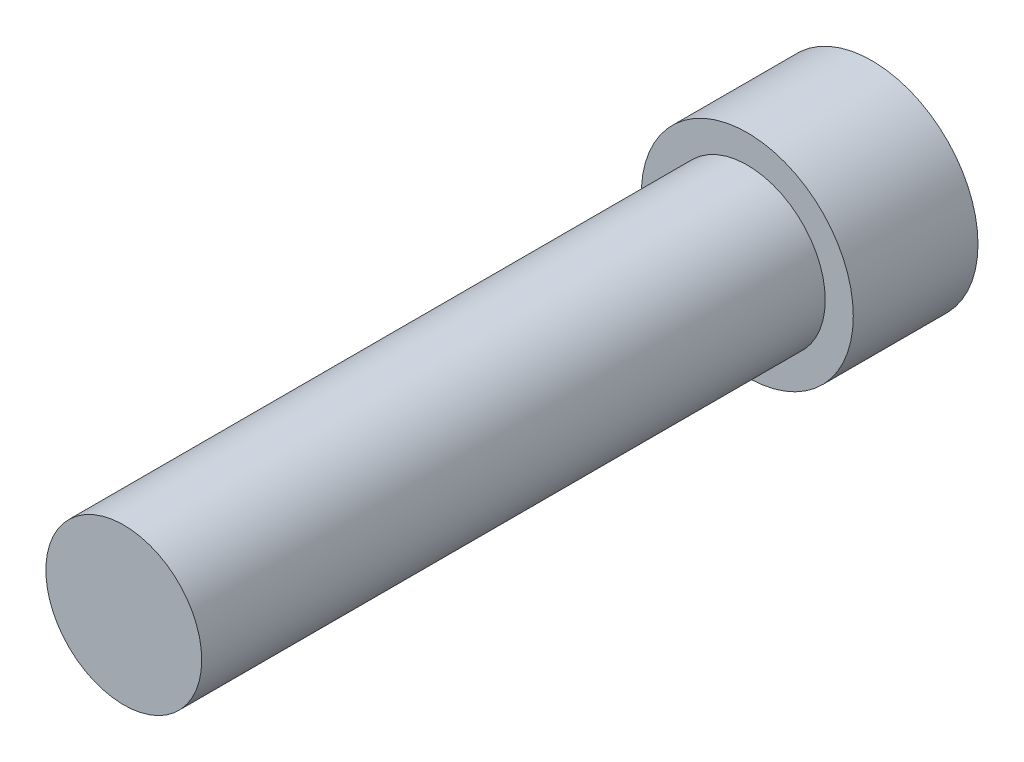
ISO-10303-21;
HEADER;
FILE_DESCRIPTION(('STEP AP214'),'2;1');
FILE_NAME('part.step','',(''),(''),'','','');
FILE_SCHEMA(('AUTOMOTIVE_DESIGN { 1 0 10303 214 1 1 1 1 }'));
ENDSEC;
DATA;
#1=APPLICATION_CONTEXT('core data for automotive mechanical design processes');
#2=APPLICATION_PROTOCOL_DEFINITION('international standard','automotive_design',2000,#1);
#3=PRODUCT_CONTEXT('',#1,'mechanical');
#4=PRODUCT('Part','Part','',(#3));
#5=PRODUCT_RELATED_PRODUCT_CATEGORY('part','',(#4));
#6=PRODUCT_DEFINITION_FORMATION('','',#4);
#7=PRODUCT_DEFINITION_CONTEXT('part definition',#1,'design');
#8=PRODUCT_DEFINITION('design','',#6,#7);
#9=PRODUCT_DEFINITION_SHAPE('','',#8);
#10=(LENGTH_UNIT() NAMED_UNIT(*) SI_UNIT(.MILLI.,.METRE.));
#11=(NAMED_UNIT(*) PLANE_ANGLE_UNIT() SI_UNIT($,.RADIAN.));
#12=(NAMED_UNIT(*) SI_UNIT($,.STERADIAN.) SOLID_ANGLE_UNIT());
#13=UNCERTAINTY_MEASURE_WITH_UNIT(LENGTH_MEASURE(1.E-05),#10,'distance_accuracy_value','');
#14=(GEOMETRIC_REPRESENTATION_CONTEXT(3) GLOBAL_UNCERTAINTY_ASSIGNED_CONTEXT((#13)) GLOBAL_UNIT_ASSIGNED_CONTEXT((#10,
#11,#12)) REPRESENTATION_CONTEXT('',''));
#15=CARTESIAN_POINT('',(0.,0.,0.));
#16=DIRECTION('',(0.,0.,1.));
#17=DIRECTION('',(1.,0.,0.));
#18=AXIS2_PLACEMENT_3D('',#15,#16,#17);
#19=CARTESIAN_POINT('',(0.,0.,12.));
#20=DIRECTION('',(0.,0.,-1.));
#21=DIRECTION('',(-1.,0.,0.));
#22=AXIS2_PLACEMENT_3D('',#19,#20,#21);
#23=CYLINDRICAL_SURFACE('',#22,1.25);
#24=CARTESIAN_POINT('',(0.,0.,2.));
#25=DIRECTION('',(0.,0.,1.));
#26=DIRECTION('',(1.,0.,0.));
#27=AXIS2_PLACEMENT_3D('',#24,#25,#26);
#28=CIRCLE('',#27,1.25);
#29=CARTESIAN_POINT('',(1.25,0.,2.));
#30=VERTEX_POINT('',#29);
#31=EDGE_CURVE('E134',#30,#30,#28,.T.);
#32=ORIENTED_EDGE('',*,*,#31,.T.);
#33=EDGE_LOOP('',(#32));
#34=FACE_BOUND('',#33,.T.);
#35=CARTESIAN_POINT('',(0.,0.,12.));
#36=DIRECTION('',(0.,0.,1.));
#37=DIRECTION('',(1.,0.,0.));
#38=AXIS2_PLACEMENT_3D('',#35,#36,#37);
#39=CIRCLE('',#38,1.25);
#40=CARTESIAN_POINT('',(1.25,0.,12.));
#41=VERTEX_POINT('',#40);
#42=EDGE_CURVE('E11',#41,#41,#39,.T.);
#43=ORIENTED_EDGE('',*,*,#42,.F.);
#44=EDGE_LOOP('',(#43));
#45=FACE_BOUND('',#44,.T.);
#46=ADVANCED_FACE('F33',(#34,#45),#23,.T.);
#47=CARTESIAN_POINT('',(0.,0.,12.));
#48=DIRECTION('',(0.,0.,1.));
#49=DIRECTION('',(1.,0.,0.));
#50=AXIS2_PLACEMENT_3D('',#47,#48,#49);
#51=PLANE('',#50);
#52=ORIENTED_EDGE('',*,*,#42,.T.);
#53=EDGE_LOOP('',(#52));
#54=FACE_BOUND('',#53,.T.);
#55=ADVANCED_FACE('F165',(#54),#51,.T.);
#56=CARTESIAN_POINT('',(0.,0.,2.));
#57=DIRECTION('',(0.,0.,1.));
#58=DIRECTION('',(1.,0.,0.));
#59=AXIS2_PLACEMENT_3D('',#56,#57,#58);
#60=PLANE('',#59);
#61=CARTESIAN_POINT('',(0.,0.,2.));
#62=DIRECTION('',(0.,0.,1.));
#63=DIRECTION('',(1.,0.,0.));
#64=AXIS2_PLACEMENT_3D('',#61,#62,#63);
#65=CIRCLE('',#64,1.7);
#66=CARTESIAN_POINT('',(1.7,0.,2.));
#67=VERTEX_POINT('',#66);
#68=EDGE_CURVE('E40',#67,#67,#65,.T.);
#69=ORIENTED_EDGE('',*,*,#68,.T.);
#70=EDGE_LOOP('',(#69));
#71=FACE_BOUND('',#70,.T.);
#72=ORIENTED_EDGE('',*,*,#31,.F.);
#73=EDGE_LOOP('',(#72));
#74=FACE_BOUND('',#73,.T.);
#75=ADVANCED_FACE('F159',(#71,#74),#60,.T.);
#76=CARTESIAN_POINT('',(0.,0.,2.));
#77=DIRECTION('',(0.,0.,-1.));
#78=DIRECTION('',(-1.,0.,0.));
#79=AXIS2_PLACEMENT_3D('',#76,#77,#78);
#80=CYLINDRICAL_SURFACE('',#79,1.7);
#81=ORIENTED_EDGE('',*,*,#68,.F.);
#82=EDGE_LOOP('',(#81));
#83=FACE_BOUND('',#82,.T.);
#84=CARTESIAN_POINT('',(0.,0.,0.));
#85=DIRECTION('',(0.,0.,1.));
#86=DIRECTION('',(1.,0.,0.));
#87=AXIS2_PLACEMENT_3D('',#84,#85,#86);
#88=CIRCLE('',#87,1.7);
#89=CARTESIAN_POINT('',(1.7,0.,0.));
#90=VERTEX_POINT('',#89);
#91=EDGE_CURVE('E142',#90,#90,#88,.T.);
#92=ORIENTED_EDGE('',*,*,#91,.T.);
#93=EDGE_LOOP('',(#92));
#94=FACE_BOUND('',#93,.T.);
#95=ADVANCED_FACE('F147',(#83,#94),#80,.T.);
#96=CARTESIAN_POINT('',(0.,0.,0.));
#97=DIRECTION('',(0.,0.,1.));
#98=DIRECTION('',(1.,0.,0.));
#99=AXIS2_PLACEMENT_3D('',#96,#97,#98);
#100=PLANE('',#99);
#101=DIRECTION('',(-0.0202323001143812,0.999795306066238,0.));
#102=VECTOR('',#101,1.);
#103=CARTESIAN_POINT('',(-0.988114182148874,-0.597464389206248,0.));
#104=LINE('',#103,#102);
#105=CARTESIAN_POINT('',(-0.988114182148874,-0.597464389206248,0.));
#106=VERTEX_POINT('',#105);
#107=CARTESIAN_POINT('',(-1.0114764299836,0.556999788977485,0.));
#108=VERTEX_POINT('',#107);
#109=EDGE_CURVE('E121',#106,#108,#104,.T.);
#110=ORIENTED_EDGE('',*,*,#109,.F.);
#111=DIRECTION('',(-0.875964283694991,0.482375967157074,0.));
#112=VECTOR('',#111,1.);
#113=CARTESIAN_POINT('',(0.0233622478347265,-1.15446417818373,0.));
#114=LINE('',#113,#112);
#115=CARTESIAN_POINT('',(0.0233622478347265,-1.15446417818373,0.));
#116=VERTEX_POINT('',#115);
#117=EDGE_CURVE('E47',#116,#106,#114,.T.);
#118=ORIENTED_EDGE('',*,*,#117,.F.);
#119=DIRECTION('',(-0.855731983580609,-0.517419338909164,0.));
#120=VECTOR('',#119,1.);
#121=CARTESIAN_POINT('',(1.0114764299836,-0.556999788977485,0.));
#122=LINE('',#121,#120);
#123=CARTESIAN_POINT('',(1.0114764299836,-0.556999788977485,0.));
#124=VERTEX_POINT('',#123);
#125=EDGE_CURVE('E130',#124,#116,#122,.T.);
#126=ORIENTED_EDGE('',*,*,#125,.F.);
#127=DIRECTION('',(0.0202323001143812,-0.999795306066238,0.));
#128=VECTOR('',#127,1.);
#129=CARTESIAN_POINT('',(0.988114182148874,0.597464389206248,0.));
#130=LINE('',#129,#128);
#131=CARTESIAN_POINT('',(0.988114182148874,0.597464389206248,0.));
#132=VERTEX_POINT('',#131);
#133=EDGE_CURVE('E128',#132,#124,#130,.T.);
#134=ORIENTED_EDGE('',*,*,#133,.F.);
#135=DIRECTION('',(0.875964283694991,-0.482375967157074,0.));
#136=VECTOR('',#135,1.);
#137=CARTESIAN_POINT('',(-0.0233622478347266,1.15446417818373,0.));
#138=LINE('',#137,#136);
#139=CARTESIAN_POINT('',(-0.0233622478347266,1.15446417818373,0.));
#140=VERTEX_POINT('',#139);
#141=EDGE_CURVE('E95',#140,#132,#138,.T.);
#142=ORIENTED_EDGE('',*,*,#141,.F.);
#143=DIRECTION('',(0.855731983580609,0.517419338909164,0.));
#144=VECTOR('',#143,1.);
#145=CARTESIAN_POINT('',(-1.0114764299836,0.556999788977485,0.));
#146=LINE('',#145,#144);
#147=EDGE_CURVE('E124',#108,#140,#146,.T.);
#148=ORIENTED_EDGE('',*,*,#147,.F.);
#149=EDGE_LOOP('',(#110,#118,#126,#134,#142,#148));
#150=FACE_BOUND('',#149,.T.);
#151=ORIENTED_EDGE('',*,*,#91,.F.);
#152=EDGE_LOOP('',(#151));
#153=FACE_BOUND('',#152,.T.);
#154=ADVANCED_FACE('F149',(#150,#153),#100,.F.);
#155=CARTESIAN_POINT('',(0.0233622478347265,-1.15446417818373,2.));
#156=DIRECTION('',(-0.482375967157074,-0.875964283694991,0.));
#157=DIRECTION('',(0.875964283694991,-0.482375967157074,0.));
#158=AXIS2_PLACEMENT_3D('',#155,#156,#157);
#159=PLANE('',#158);
#160=ORIENTED_EDGE('',*,*,#117,.T.);
#161=DIRECTION('',(0.,0.,-1.));
#162=VECTOR('',#161,1.);
#163=CARTESIAN_POINT('',(-0.988114182148874,-0.597464389206248,2.));
#164=LINE('',#163,#162);
#165=CARTESIAN_POINT('',(-0.988114182148874,-0.597464389206248,2.));
#166=VERTEX_POINT('',#165);
#167=EDGE_CURVE('E77',#166,#106,#164,.T.);
#168=ORIENTED_EDGE('',*,*,#167,.F.);
#169=DIRECTION('',(-0.875964283694991,0.482375967157074,0.));
#170=VECTOR('',#169,1.);
#171=CARTESIAN_POINT('',(0.0233622478347265,-1.15446417818373,2.));
#172=LINE('',#171,#170);
#173=CARTESIAN_POINT('',(0.0233622478347265,-1.15446417818373,2.));
#174=VERTEX_POINT('',#173);
#175=EDGE_CURVE('E132',#174,#166,#172,.T.);
#176=ORIENTED_EDGE('',*,*,#175,.F.);
#177=DIRECTION('',(0.,0.,-1.));
#178=VECTOR('',#177,1.);
#179=CARTESIAN_POINT('',(0.0233622478347265,-1.15446417818373,2.));
#180=LINE('',#179,#178);
#181=EDGE_CURVE('E55',#174,#116,#180,.T.);
#182=ORIENTED_EDGE('',*,*,#181,.T.);
#183=EDGE_LOOP('',(#160,#168,#176,#182));
#184=FACE_BOUND('',#183,.T.);
#185=ADVANCED_FACE('F151',(#184),#159,.F.);
#186=CARTESIAN_POINT('',(1.0114764299836,-0.556999788977485,2.));
#187=DIRECTION('',(0.517419338909164,-0.855731983580609,0.));
#188=DIRECTION('',(0.855731983580609,0.517419338909164,0.));
#189=AXIS2_PLACEMENT_3D('',#186,#187,#188);
#190=PLANE('',#189);
#191=ORIENTED_EDGE('',*,*,#125,.T.);
#192=ORIENTED_EDGE('',*,*,#181,.F.);
#193=DIRECTION('',(-0.855731983580609,-0.517419338909164,0.));
#194=VECTOR('',#193,1.);
#195=CARTESIAN_POINT('',(1.0114764299836,-0.556999788977485,2.));
#196=LINE('',#195,#194);
#197=CARTESIAN_POINT('',(1.0114764299836,-0.556999788977485,2.));
#198=VERTEX_POINT('',#197);
#199=EDGE_CURVE('E107',#198,#174,#196,.T.);
#200=ORIENTED_EDGE('',*,*,#199,.F.);
#201=DIRECTION('',(0.,0.,-1.));
#202=VECTOR('',#201,1.);
#203=CARTESIAN_POINT('',(1.0114764299836,-0.556999788977485,2.));
#204=LINE('',#203,#202);
#205=EDGE_CURVE('E99',#198,#124,#204,.T.);
#206=ORIENTED_EDGE('',*,*,#205,.T.);
#207=EDGE_LOOP('',(#191,#192,#200,#206));
#208=FACE_BOUND('',#207,.T.);
#209=ADVANCED_FACE('F157',(#208),#190,.F.);
#210=CARTESIAN_POINT('',(0.988114182148874,0.597464389206248,2.));
#211=DIRECTION('',(0.999795306066238,0.0202323001143812,0.));
#212=DIRECTION('',(-0.0202323001143812,0.999795306066238,0.));
#213=AXIS2_PLACEMENT_3D('',#210,#211,#212);
#214=PLANE('',#213);
#215=ORIENTED_EDGE('',*,*,#133,.T.);
#216=ORIENTED_EDGE('',*,*,#205,.F.);
#217=DIRECTION('',(0.0202323001143812,-0.999795306066238,0.));
#218=VECTOR('',#217,1.);
#219=CARTESIAN_POINT('',(0.988114182148874,0.597464389206248,2.));
#220=LINE('',#219,#218);
#221=CARTESIAN_POINT('',(0.988114182148874,0.597464389206248,2.));
#222=VERTEX_POINT('',#221);
#223=EDGE_CURVE('E103',#222,#198,#220,.T.);
#224=ORIENTED_EDGE('',*,*,#223,.F.);
#225=DIRECTION('',(0.,0.,-1.));
#226=VECTOR('',#225,1.);
#227=CARTESIAN_POINT('',(0.988114182148874,0.597464389206248,2.));
#228=LINE('',#227,#226);
#229=EDGE_CURVE('E88',#222,#132,#228,.T.);
#230=ORIENTED_EDGE('',*,*,#229,.T.);
#231=EDGE_LOOP('',(#215,#216,#224,#230));
#232=FACE_BOUND('',#231,.T.);
#233=ADVANCED_FACE('F104',(#232),#214,.F.);
#234=CARTESIAN_POINT('',(-0.0233622478347266,1.15446417818373,2.));
#235=DIRECTION('',(0.482375967157074,0.875964283694991,0.));
#236=DIRECTION('',(-0.875964283694991,0.482375967157074,0.));
#237=AXIS2_PLACEMENT_3D('',#234,#235,#236);
#238=PLANE('',#237);
#239=ORIENTED_EDGE('',*,*,#141,.T.);
#240=ORIENTED_EDGE('',*,*,#229,.F.);
#241=DIRECTION('',(0.875964283694991,-0.482375967157074,0.));
#242=VECTOR('',#241,1.);
#243=CARTESIAN_POINT('',(-0.0233622478347266,1.15446417818373,2.));
#244=LINE('',#243,#242);
#245=CARTESIAN_POINT('',(-0.0233622478347266,1.15446417818373,2.));
#246=VERTEX_POINT('',#245);
#247=EDGE_CURVE('E92',#246,#222,#244,.T.);
#248=ORIENTED_EDGE('',*,*,#247,.F.);
#249=DIRECTION('',(0.,0.,-1.));
#250=VECTOR('',#249,1.);
#251=CARTESIAN_POINT('',(-0.0233622478347266,1.15446417818373,2.));
#252=LINE('',#251,#250);
#253=EDGE_CURVE('E100',#246,#140,#252,.T.);
#254=ORIENTED_EDGE('',*,*,#253,.T.);
#255=EDGE_LOOP('',(#239,#240,#248,#254));
#256=FACE_BOUND('',#255,.T.);
#257=ADVANCED_FACE('F90',(#256),#238,.F.);
#258=CARTESIAN_POINT('',(-1.0114764299836,0.556999788977485,2.));
#259=DIRECTION('',(-0.517419338909164,0.855731983580609,0.));
#260=DIRECTION('',(-0.855731983580609,-0.517419338909164,0.));
#261=AXIS2_PLACEMENT_3D('',#258,#259,#260);
#262=PLANE('',#261);
#263=ORIENTED_EDGE('',*,*,#147,.T.);
#264=ORIENTED_EDGE('',*,*,#253,.F.);
#265=DIRECTION('',(0.855731983580609,0.517419338909164,0.));
#266=VECTOR('',#265,1.);
#267=CARTESIAN_POINT('',(-1.0114764299836,0.556999788977485,2.));
#268=LINE('',#267,#266);
#269=CARTESIAN_POINT('',(-1.0114764299836,0.556999788977485,2.));
#270=VERTEX_POINT('',#269);
#271=EDGE_CURVE('E113',#270,#246,#268,.T.);
#272=ORIENTED_EDGE('',*,*,#271,.F.);
#273=DIRECTION('',(0.,0.,-1.));
#274=VECTOR('',#273,1.);
#275=CARTESIAN_POINT('',(-1.0114764299836,0.556999788977485,2.));
#276=LINE('',#275,#274);
#277=EDGE_CURVE('E137',#270,#108,#276,.T.);
#278=ORIENTED_EDGE('',*,*,#277,.T.);
#279=EDGE_LOOP('',(#263,#264,#272,#278));
#280=FACE_BOUND('',#279,.T.);
#281=ADVANCED_FACE('F184',(#280),#262,.F.);
#282=CARTESIAN_POINT('',(-0.988114182148874,-0.597464389206248,2.));
#283=DIRECTION('',(-0.999795306066238,-0.0202323001143812,0.));
#284=DIRECTION('',(0.0202323001143812,-0.999795306066238,0.));
#285=AXIS2_PLACEMENT_3D('',#282,#283,#284);
#286=PLANE('',#285);
#287=ORIENTED_EDGE('',*,*,#109,.T.);
#288=ORIENTED_EDGE('',*,*,#277,.F.);
#289=DIRECTION('',(-0.0202323001143812,0.999795306066238,0.));
#290=VECTOR('',#289,1.);
#291=CARTESIAN_POINT('',(-0.988114182148874,-0.597464389206248,2.));
#292=LINE('',#291,#290);
#293=EDGE_CURVE('E115',#166,#270,#292,.T.);
#294=ORIENTED_EDGE('',*,*,#293,.F.);
#295=ORIENTED_EDGE('',*,*,#167,.T.);
#296=EDGE_LOOP('',(#287,#288,#294,#295));
#297=FACE_BOUND('',#296,.T.);
#298=ADVANCED_FACE('F181',(#297),#286,.F.);
#299=CARTESIAN_POINT('',(0.,0.,2.));
#300=DIRECTION('',(0.,0.,-1.));
#301=DIRECTION('',(-1.,0.,0.));
#302=AXIS2_PLACEMENT_3D('',#299,#300,#301);
#303=PLANE('',#302);
#304=ORIENTED_EDGE('',*,*,#175,.T.);
#305=ORIENTED_EDGE('',*,*,#293,.T.);
#306=ORIENTED_EDGE('',*,*,#271,.T.);
#307=ORIENTED_EDGE('',*,*,#247,.T.);
#308=ORIENTED_EDGE('',*,*,#223,.T.);
#309=ORIENTED_EDGE('',*,*,#199,.T.);
#310=EDGE_LOOP('',(#304,#305,#306,#307,#308,#309));
#311=FACE_BOUND('',#310,.T.);
#312=ADVANCED_FACE('F110',(#311),#303,.T.);
#313=CLOSED_SHELL('',(#46,#55,#75,#95,#154,#185,#209,#233,#257,#281,#298,#312));
#314=MANIFOLD_SOLID_BREP('B2',#313);
#315=ADVANCED_BREP_SHAPE_REPRESENTATION('',(#18,#314),#14);
#316=SHAPE_DEFINITION_REPRESENTATION(#9,#315);
ENDSEC;
END-ISO-10303-21;
